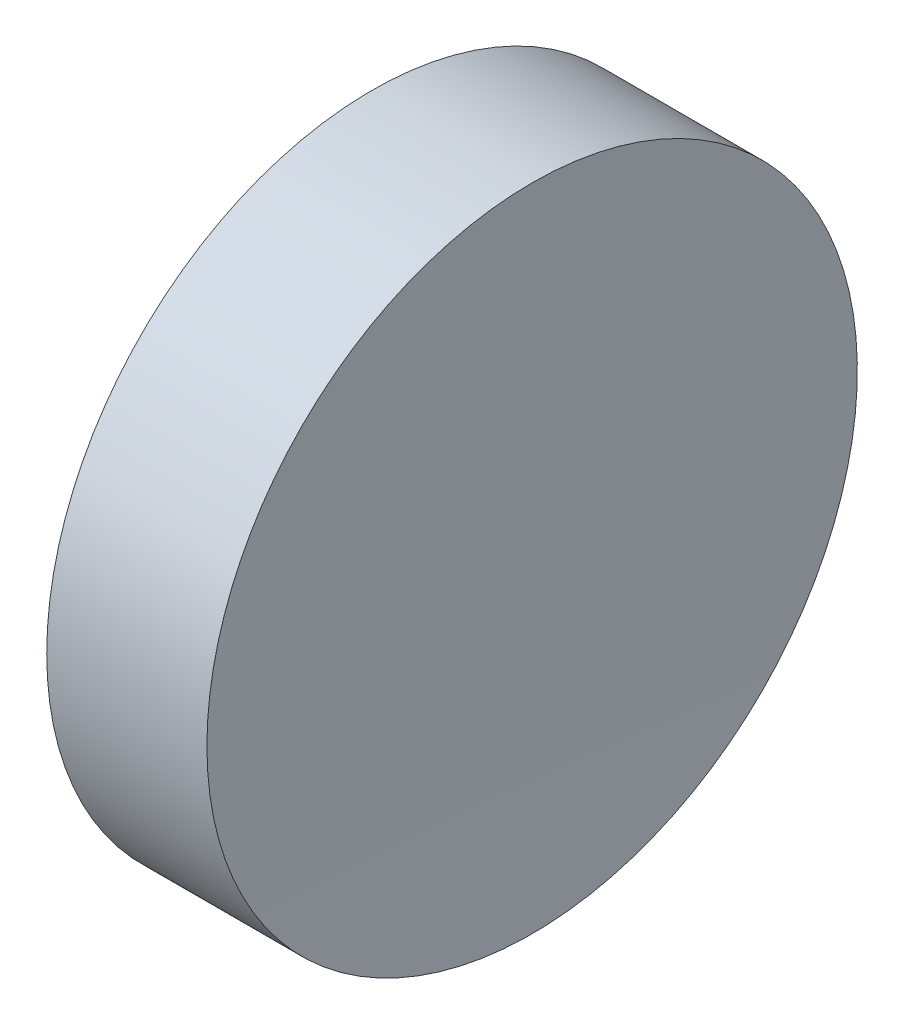
ISO-10303-21;
HEADER;
FILE_DESCRIPTION(('STEP AP214'),'2;1');
FILE_NAME('part.step','',(''),(''),'','','');
FILE_SCHEMA(('AUTOMOTIVE_DESIGN { 1 0 10303 214 1 1 1 1 }'));
ENDSEC;
DATA;
#1=APPLICATION_CONTEXT('core data for automotive mechanical design processes');
#2=APPLICATION_PROTOCOL_DEFINITION('international standard','automotive_design',2000,#1);
#3=PRODUCT_CONTEXT('',#1,'mechanical');
#4=PRODUCT('Part','Part','',(#3));
#5=PRODUCT_RELATED_PRODUCT_CATEGORY('part','',(#4));
#6=PRODUCT_DEFINITION_FORMATION('','',#4);
#7=PRODUCT_DEFINITION_CONTEXT('part definition',#1,'design');
#8=PRODUCT_DEFINITION('design','',#6,#7);
#9=PRODUCT_DEFINITION_SHAPE('','',#8);
#10=(LENGTH_UNIT() NAMED_UNIT(*) SI_UNIT(.MILLI.,.METRE.));
#11=(NAMED_UNIT(*) PLANE_ANGLE_UNIT() SI_UNIT($,.RADIAN.));
#12=(NAMED_UNIT(*) SI_UNIT($,.STERADIAN.) SOLID_ANGLE_UNIT());
#13=UNCERTAINTY_MEASURE_WITH_UNIT(LENGTH_MEASURE(1.E-05),#10,'distance_accuracy_value','');
#14=(GEOMETRIC_REPRESENTATION_CONTEXT(3) GLOBAL_UNCERTAINTY_ASSIGNED_CONTEXT((#13)) GLOBAL_UNIT_ASSIGNED_CONTEXT((#10,
#11,#12)) REPRESENTATION_CONTEXT('',''));
#15=CARTESIAN_POINT('',(0.,0.,0.));
#16=DIRECTION('',(0.,0.,1.));
#17=DIRECTION('',(1.,0.,0.));
#18=AXIS2_PLACEMENT_3D('',#15,#16,#17);
#19=CARTESIAN_POINT('',(621.092655511726,69.3780211233715,0.));
#20=DIRECTION('',(-1.,0.,0.));
#21=DIRECTION('',(0.,1.,0.));
#22=AXIS2_PLACEMENT_3D('',#19,#20,#21);
#23=SPHERICAL_SURFACE('',#22,500.);
#24=CARTESIAN_POINT('',(121.248929933421,69.3780211233724,0.));
#25=DIRECTION('',(-1.,0.,0.));
#26=DIRECTION('',(0.,0.,1.));
#27=AXIS2_PLACEMENT_3D('',#24,#25,#26);
#28=CIRCLE('',#27,12.5);
#29=CARTESIAN_POINT('',(121.248929933421,69.3780211233724,12.5));
#30=VERTEX_POINT('',#29);
#31=EDGE_CURVE('E10',#30,#30,#28,.T.);
#32=ORIENTED_EDGE('',*,*,#31,.F.);
#33=EDGE_LOOP('',(#32));
#34=FACE_BOUND('',#33,.T.);
#35=ADVANCED_FACE('F35',(#34),#23,.F.);
#36=CARTESIAN_POINT('',(108.985143002165,69.3780211233724,0.));
#37=DIRECTION('',(-1.,0.,0.));
#38=DIRECTION('',(0.,0.,1.));
#39=AXIS2_PLACEMENT_3D('',#36,#37,#38);
#40=CYLINDRICAL_SURFACE('',#39,12.5);
#41=CARTESIAN_POINT('',(115.09265553492,69.3780211233724,0.));
#42=DIRECTION('',(-1.,0.,0.));
#43=DIRECTION('',(0.,0.,1.));
#44=AXIS2_PLACEMENT_3D('',#41,#42,#43);
#45=CIRCLE('',#44,12.5);
#46=CARTESIAN_POINT('',(115.09265553492,69.3780211233724,12.5));
#47=VERTEX_POINT('',#46);
#48=EDGE_CURVE('E41',#47,#47,#45,.T.);
#49=ORIENTED_EDGE('',*,*,#48,.F.);
#50=EDGE_LOOP('',(#49));
#51=FACE_BOUND('',#50,.T.);
#52=ORIENTED_EDGE('',*,*,#31,.T.);
#53=EDGE_LOOP('',(#52));
#54=FACE_BOUND('',#53,.T.);
#55=ADVANCED_FACE('F49',(#51,#54),#40,.T.);
#56=CARTESIAN_POINT('',(115.09265553492,69.3780211233724,0.));
#57=DIRECTION('',(1.,0.,0.));
#58=DIRECTION('',(0.,0.,-1.));
#59=AXIS2_PLACEMENT_3D('',#56,#57,#58);
#60=PLANE('',#59);
#61=ORIENTED_EDGE('',*,*,#48,.T.);
#62=EDGE_LOOP('',(#61));
#63=FACE_BOUND('',#62,.T.);
#64=ADVANCED_FACE('F47',(#63),#60,.F.);
#65=CLOSED_SHELL('',(#35,#55,#64));
#66=MANIFOLD_SOLID_BREP('B2',#65);
#67=ADVANCED_BREP_SHAPE_REPRESENTATION('',(#18,#66),#14);
#68=SHAPE_DEFINITION_REPRESENTATION(#9,#67);
ENDSEC;
END-ISO-10303-21;
